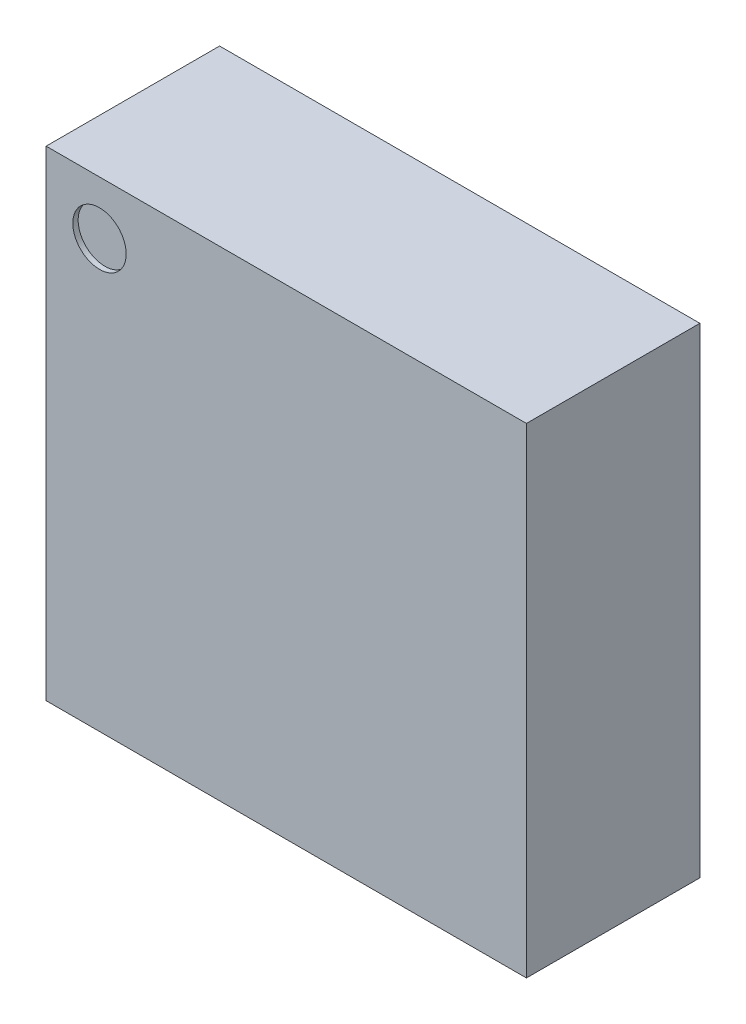
ISO-10303-21;
HEADER;
FILE_DESCRIPTION(('STEP AP214'),'2;1');
FILE_NAME('part.step','',(''),(''),'','','');
FILE_SCHEMA(('AUTOMOTIVE_DESIGN { 1 0 10303 214 1 1 1 1 }'));
ENDSEC;
DATA;
#1=APPLICATION_CONTEXT('core data for automotive mechanical design processes');
#2=APPLICATION_PROTOCOL_DEFINITION('international standard','automotive_design',2000,#1);
#3=PRODUCT_CONTEXT('',#1,'mechanical');
#4=PRODUCT('Part','Part','',(#3));
#5=PRODUCT_RELATED_PRODUCT_CATEGORY('part','',(#4));
#6=PRODUCT_DEFINITION_FORMATION('','',#4);
#7=PRODUCT_DEFINITION_CONTEXT('part definition',#1,'design');
#8=PRODUCT_DEFINITION('design','',#6,#7);
#9=PRODUCT_DEFINITION_SHAPE('','',#8);
#10=(LENGTH_UNIT() NAMED_UNIT(*) SI_UNIT(.MILLI.,.METRE.));
#11=(NAMED_UNIT(*) PLANE_ANGLE_UNIT() SI_UNIT($,.RADIAN.));
#12=(NAMED_UNIT(*) SI_UNIT($,.STERADIAN.) SOLID_ANGLE_UNIT());
#13=UNCERTAINTY_MEASURE_WITH_UNIT(LENGTH_MEASURE(1.E-05),#10,'distance_accuracy_value','');
#14=(GEOMETRIC_REPRESENTATION_CONTEXT(3) GLOBAL_UNCERTAINTY_ASSIGNED_CONTEXT((#13)) GLOBAL_UNIT_ASSIGNED_CONTEXT((#10,
#11,#12)) REPRESENTATION_CONTEXT('',''));
#15=CARTESIAN_POINT('',(0.,0.,0.));
#16=DIRECTION('',(0.,0.,1.));
#17=DIRECTION('',(1.,0.,0.));
#18=AXIS2_PLACEMENT_3D('',#15,#16,#17);
#19=CARTESIAN_POINT('',(0.,-0.4499999999995,0.44625));
#20=DIRECTION('',(0.,0.,1.));
#21=DIRECTION('',(1.,0.,0.));
#22=AXIS2_PLACEMENT_3D('',#19,#20,#21);
#23=PLANE('',#22);
#24=CARTESIAN_POINT('',(-0.35,0.3499999999995,0.44625));
#25=DIRECTION('',(0.,0.,1.));
#26=DIRECTION('',(1.,0.,0.));
#27=AXIS2_PLACEMENT_3D('',#24,#25,#26);
#28=CIRCLE('',#27,0.05);
#29=CARTESIAN_POINT('',(-0.3,0.3499999999995,0.44625));
#30=VERTEX_POINT('',#29);
#31=EDGE_CURVE('E20',#30,#30,#28,.T.);
#32=ORIENTED_EDGE('',*,*,#31,.T.);
#33=EDGE_LOOP('',(#32));
#34=FACE_BOUND('',#33,.T.);
#35=ADVANCED_FACE('F17',(#34),#23,.T.);
#36=CARTESIAN_POINT('',(-0.35,0.3499999999995,0.45625));
#37=DIRECTION('',(0.,0.,1.));
#38=DIRECTION('',(1.,0.,0.));
#39=AXIS2_PLACEMENT_3D('',#36,#37,#38);
#40=CYLINDRICAL_SURFACE('',#39,0.05);
#41=ORIENTED_EDGE('',*,*,#31,.F.);
#42=EDGE_LOOP('',(#41));
#43=FACE_BOUND('',#42,.T.);
#44=CARTESIAN_POINT('',(-0.35,0.3499999999995,0.45625));
#45=DIRECTION('',(0.,0.,1.));
#46=DIRECTION('',(1.,0.,0.));
#47=AXIS2_PLACEMENT_3D('',#44,#45,#46);
#48=CIRCLE('',#47,0.05);
#49=CARTESIAN_POINT('',(-0.3,0.3499999999995,0.45625));
#50=VERTEX_POINT('',#49);
#51=EDGE_CURVE('E69',#50,#50,#48,.F.);
#52=ORIENTED_EDGE('',*,*,#51,.F.);
#53=EDGE_LOOP('',(#52));
#54=FACE_BOUND('',#53,.T.);
#55=ADVANCED_FACE('F89',(#43,#54),#40,.F.);
#56=CARTESIAN_POINT('',(-0.45,-0.4499999999995,0.45625));
#57=DIRECTION('',(0.,0.,1.));
#58=DIRECTION('',(1.,0.,0.));
#59=AXIS2_PLACEMENT_3D('',#56,#57,#58);
#60=PLANE('',#59);
#61=ORIENTED_EDGE('',*,*,#51,.T.);
#62=EDGE_LOOP('',(#61));
#63=FACE_BOUND('',#62,.T.);
#64=DIRECTION('',(0.,1.,0.));
#65=VECTOR('',#64,1.);
#66=CARTESIAN_POINT('',(-0.45,-0.4499999999995,0.45625));
#67=LINE('',#66,#65);
#68=CARTESIAN_POINT('',(-0.45,-0.4499999999995,0.45625));
#69=VERTEX_POINT('',#68);
#70=CARTESIAN_POINT('',(-0.45,0.4499999999995,0.45625));
#71=VERTEX_POINT('',#70);
#72=EDGE_CURVE('E60',#69,#71,#67,.T.);
#73=ORIENTED_EDGE('',*,*,#72,.F.);
#74=DIRECTION('',(1.,0.,0.));
#75=VECTOR('',#74,1.);
#76=CARTESIAN_POINT('',(0.,-0.4499999999995,0.45625));
#77=LINE('',#76,#75);
#78=CARTESIAN_POINT('',(0.45,-0.4499999999995,0.45625));
#79=VERTEX_POINT('',#78);
#80=EDGE_CURVE('E197',#69,#79,#77,.T.);
#81=ORIENTED_EDGE('',*,*,#80,.T.);
#82=DIRECTION('',(0.,1.,0.));
#83=VECTOR('',#82,1.);
#84=CARTESIAN_POINT('',(0.45,-0.4499999999995,0.45625));
#85=LINE('',#84,#83);
#86=CARTESIAN_POINT('',(0.45,0.4499999999995,0.45625));
#87=VERTEX_POINT('',#86);
#88=EDGE_CURVE('E72',#87,#79,#85,.F.);
#89=ORIENTED_EDGE('',*,*,#88,.F.);
#90=DIRECTION('',(1.,0.,0.));
#91=VECTOR('',#90,1.);
#92=CARTESIAN_POINT('',(0.,0.4499999999995,0.45625));
#93=LINE('',#92,#91);
#94=EDGE_CURVE('E55',#71,#87,#93,.T.);
#95=ORIENTED_EDGE('',*,*,#94,.F.);
#96=EDGE_LOOP('',(#73,#81,#89,#95));
#97=FACE_BOUND('',#96,.T.);
#98=ADVANCED_FACE('F71',(#63,#97),#60,.T.);
#99=CARTESIAN_POINT('',(-0.45,-0.4499999999995,0.13125));
#100=DIRECTION('',(-1.,0.,0.));
#101=DIRECTION('',(0.,0.,1.));
#102=AXIS2_PLACEMENT_3D('',#99,#100,#101);
#103=PLANE('',#102);
#104=DIRECTION('',(0.,1.,0.));
#105=VECTOR('',#104,1.);
#106=CARTESIAN_POINT('',(-0.45,-0.4499999999995,0.13125));
#107=LINE('',#106,#105);
#108=CARTESIAN_POINT('',(-0.45,-0.4499999999995,0.13125));
#109=VERTEX_POINT('',#108);
#110=CARTESIAN_POINT('',(-0.45,0.4499999999995,0.13125));
#111=VERTEX_POINT('',#110);
#112=EDGE_CURVE('E198',#109,#111,#107,.T.);
#113=ORIENTED_EDGE('',*,*,#112,.F.);
#114=DIRECTION('',(0.,0.,1.));
#115=VECTOR('',#114,1.);
#116=CARTESIAN_POINT('',(-0.45,-0.4499999999995,0.));
#117=LINE('',#116,#115);
#118=EDGE_CURVE('E65',#109,#69,#117,.T.);
#119=ORIENTED_EDGE('',*,*,#118,.T.);
#120=ORIENTED_EDGE('',*,*,#72,.T.);
#121=DIRECTION('',(0.,0.,1.));
#122=VECTOR('',#121,1.);
#123=CARTESIAN_POINT('',(-0.45,0.4499999999995,0.));
#124=LINE('',#123,#122);
#125=EDGE_CURVE('E62',#111,#71,#124,.T.);
#126=ORIENTED_EDGE('',*,*,#125,.F.);
#127=EDGE_LOOP('',(#113,#119,#120,#126));
#128=FACE_BOUND('',#127,.T.);
#129=ADVANCED_FACE('F61',(#128),#103,.T.);
#130=CARTESIAN_POINT('',(0.,0.4499999999995,0.));
#131=DIRECTION('',(0.,1.,0.));
#132=DIRECTION('',(0.,0.,1.));
#133=AXIS2_PLACEMENT_3D('',#130,#131,#132);
#134=PLANE('',#133);
#135=ORIENTED_EDGE('',*,*,#94,.T.);
#136=DIRECTION('',(0.,0.,-1.));
#137=VECTOR('',#136,1.);
#138=CARTESIAN_POINT('',(0.45,0.4499999999995,0.45625));
#139=LINE('',#138,#137);
#140=CARTESIAN_POINT('',(0.45,0.4499999999995,0.13125));
#141=VERTEX_POINT('',#140);
#142=EDGE_CURVE('E74',#141,#87,#139,.F.);
#143=ORIENTED_EDGE('',*,*,#142,.F.);
#144=DIRECTION('',(-1.,0.,0.));
#145=VECTOR('',#144,1.);
#146=CARTESIAN_POINT('',(0.45,0.4499999999995,0.13125));
#147=LINE('',#146,#145);
#148=EDGE_CURVE('E78',#111,#141,#147,.F.);
#149=ORIENTED_EDGE('',*,*,#148,.F.);
#150=ORIENTED_EDGE('',*,*,#125,.T.);
#151=EDGE_LOOP('',(#135,#143,#149,#150));
#152=FACE_BOUND('',#151,.T.);
#153=ADVANCED_FACE('F76',(#152),#134,.T.);
#154=CARTESIAN_POINT('',(0.45,-0.4499999999995,0.45625));
#155=DIRECTION('',(1.,0.,0.));
#156=DIRECTION('',(0.,0.,-1.));
#157=AXIS2_PLACEMENT_3D('',#154,#155,#156);
#158=PLANE('',#157);
#159=ORIENTED_EDGE('',*,*,#88,.T.);
#160=DIRECTION('',(0.,0.,1.));
#161=VECTOR('',#160,1.);
#162=CARTESIAN_POINT('',(0.45,-0.4499999999995,0.));
#163=LINE('',#162,#161);
#164=CARTESIAN_POINT('',(0.45,-0.4499999999995,0.13125));
#165=VERTEX_POINT('',#164);
#166=EDGE_CURVE('E35',#79,#165,#163,.F.);
#167=ORIENTED_EDGE('',*,*,#166,.T.);
#168=DIRECTION('',(0.,1.,0.));
#169=VECTOR('',#168,1.);
#170=CARTESIAN_POINT('',(0.45,-0.4499999999995,0.13125));
#171=LINE('',#170,#169);
#172=EDGE_CURVE('E26',#141,#165,#171,.F.);
#173=ORIENTED_EDGE('',*,*,#172,.F.);
#174=ORIENTED_EDGE('',*,*,#142,.T.);
#175=EDGE_LOOP('',(#159,#167,#173,#174));
#176=FACE_BOUND('',#175,.T.);
#177=ADVANCED_FACE('F106',(#176),#158,.T.);
#178=CARTESIAN_POINT('',(0.,-0.4499999999995,0.));
#179=DIRECTION('',(0.,1.,0.));
#180=DIRECTION('',(0.,0.,1.));
#181=AXIS2_PLACEMENT_3D('',#178,#179,#180);
#182=PLANE('',#181);
#183=ORIENTED_EDGE('',*,*,#118,.F.);
#184=DIRECTION('',(-1.,0.,0.));
#185=VECTOR('',#184,1.);
#186=CARTESIAN_POINT('',(0.45,-0.4499999999995,0.13125));
#187=LINE('',#186,#185);
#188=EDGE_CURVE('E11',#165,#109,#187,.T.);
#189=ORIENTED_EDGE('',*,*,#188,.F.);
#190=ORIENTED_EDGE('',*,*,#166,.F.);
#191=ORIENTED_EDGE('',*,*,#80,.F.);
#192=EDGE_LOOP('',(#183,#189,#190,#191));
#193=FACE_BOUND('',#192,.T.);
#194=ADVANCED_FACE('F100',(#193),#182,.F.);
#195=CARTESIAN_POINT('',(0.45,-0.4499999999995,0.13125));
#196=DIRECTION('',(0.,0.,-1.));
#197=DIRECTION('',(-1.,0.,0.));
#198=AXIS2_PLACEMENT_3D('',#195,#196,#197);
#199=PLANE('',#198);
#200=ORIENTED_EDGE('',*,*,#172,.T.);
#201=ORIENTED_EDGE('',*,*,#188,.T.);
#202=ORIENTED_EDGE('',*,*,#112,.T.);
#203=ORIENTED_EDGE('',*,*,#148,.T.);
#204=EDGE_LOOP('',(#200,#201,#202,#203));
#205=FACE_BOUND('',#204,.T.);
#206=ADVANCED_FACE('F98',(#205),#199,.T.);
#207=CLOSED_SHELL('',(#35,#55,#98,#129,#153,#177,#194,#206));
#208=MANIFOLD_SOLID_BREP('B1',#207);
#209=ADVANCED_BREP_SHAPE_REPRESENTATION('',(#18,#208),#14);
#210=SHAPE_DEFINITION_REPRESENTATION(#9,#209);
ENDSEC;
END-ISO-10303-21;
